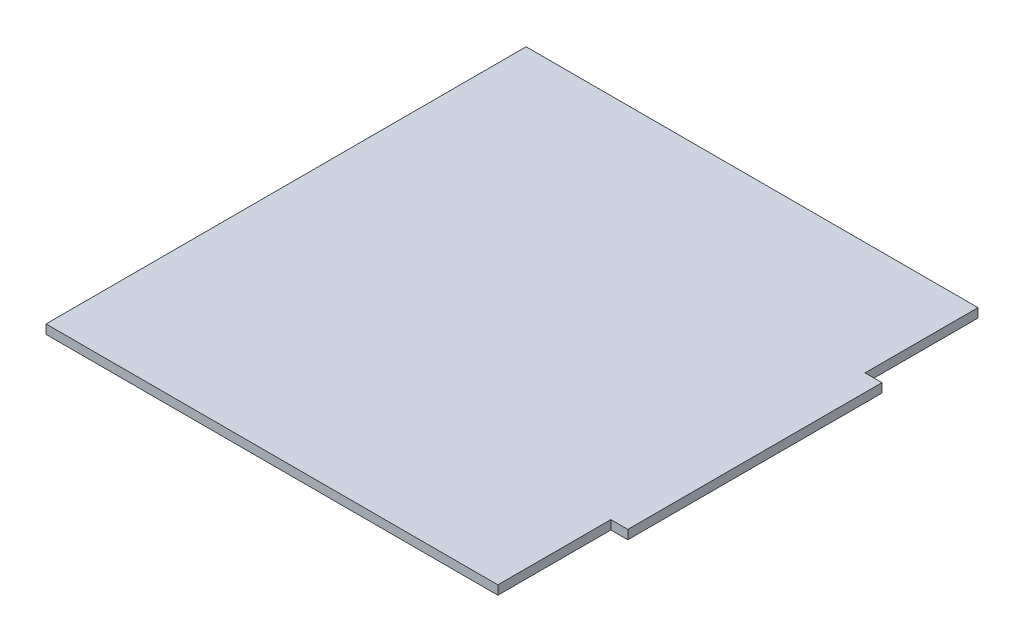
ISO-10303-21;
HEADER;
FILE_DESCRIPTION(('STEP AP214'),'2;1');
FILE_NAME('part.step','',(''),(''),'','','');
FILE_SCHEMA(('AUTOMOTIVE_DESIGN { 1 0 10303 214 1 1 1 1 }'));
ENDSEC;
DATA;
#1=APPLICATION_CONTEXT('core data for automotive mechanical design processes');
#2=APPLICATION_PROTOCOL_DEFINITION('international standard','automotive_design',2000,#1);
#3=PRODUCT_CONTEXT('',#1,'mechanical');
#4=PRODUCT('Part','Part','',(#3));
#5=PRODUCT_RELATED_PRODUCT_CATEGORY('part','',(#4));
#6=PRODUCT_DEFINITION_FORMATION('','',#4);
#7=PRODUCT_DEFINITION_CONTEXT('part definition',#1,'design');
#8=PRODUCT_DEFINITION('design','',#6,#7);
#9=PRODUCT_DEFINITION_SHAPE('','',#8);
#10=(LENGTH_UNIT() NAMED_UNIT(*) SI_UNIT(.MILLI.,.METRE.));
#11=(NAMED_UNIT(*) PLANE_ANGLE_UNIT() SI_UNIT($,.RADIAN.));
#12=(NAMED_UNIT(*) SI_UNIT($,.STERADIAN.) SOLID_ANGLE_UNIT());
#13=UNCERTAINTY_MEASURE_WITH_UNIT(LENGTH_MEASURE(1.E-05),#10,'distance_accuracy_value','');
#14=(GEOMETRIC_REPRESENTATION_CONTEXT(3) GLOBAL_UNCERTAINTY_ASSIGNED_CONTEXT((#13)) GLOBAL_UNIT_ASSIGNED_CONTEXT((#10,
#11,#12)) REPRESENTATION_CONTEXT('',''));
#15=CARTESIAN_POINT('',(0.,0.,0.));
#16=DIRECTION('',(0.,0.,1.));
#17=DIRECTION('',(1.,0.,0.));
#18=AXIS2_PLACEMENT_3D('',#15,#16,#17);
#19=CARTESIAN_POINT('',(41.5,1.6,42.5));
#20=DIRECTION('',(-1.,0.,0.));
#21=DIRECTION('',(0.,0.,1.));
#22=AXIS2_PLACEMENT_3D('',#19,#20,#21);
#23=PLANE('',#22);
#24=DIRECTION('',(0.,0.,-1.));
#25=VECTOR('',#24,1.);
#26=CARTESIAN_POINT('',(41.5,0.,42.5));
#27=LINE('',#26,#25);
#28=CARTESIAN_POINT('',(41.5,0.,22.5));
#29=VERTEX_POINT('',#28);
#30=CARTESIAN_POINT('',(41.5,0.,-22.5));
#31=VERTEX_POINT('',#30);
#32=EDGE_CURVE('E132',#29,#31,#27,.T.);
#33=ORIENTED_EDGE('',*,*,#32,.T.);
#34=DIRECTION('',(0.,1.,0.));
#35=VECTOR('',#34,1.);
#36=CARTESIAN_POINT('',(41.5,-8.4,-22.5));
#37=LINE('',#36,#35);
#38=CARTESIAN_POINT('',(41.5,1.6,-22.5));
#39=VERTEX_POINT('',#38);
#40=EDGE_CURVE('E136',#31,#39,#37,.T.);
#41=ORIENTED_EDGE('',*,*,#40,.T.);
#42=DIRECTION('',(0.,0.,-1.));
#43=VECTOR('',#42,1.);
#44=CARTESIAN_POINT('',(41.5,1.6,42.5));
#45=LINE('',#44,#43);
#46=CARTESIAN_POINT('',(41.5,1.6,22.5));
#47=VERTEX_POINT('',#46);
#48=EDGE_CURVE('E121',#47,#39,#45,.T.);
#49=ORIENTED_EDGE('',*,*,#48,.F.);
#50=DIRECTION('',(0.,1.,0.));
#51=VECTOR('',#50,1.);
#52=CARTESIAN_POINT('',(41.5,-8.4,22.5));
#53=LINE('',#52,#51);
#54=EDGE_CURVE('E161',#29,#47,#53,.T.);
#55=ORIENTED_EDGE('',*,*,#54,.F.);
#56=EDGE_LOOP('',(#33,#41,#49,#55));
#57=FACE_BOUND('',#56,.T.);
#58=ADVANCED_FACE('F37',(#57),#23,.F.);
#59=CARTESIAN_POINT('',(-41.5,1.6,-42.5));
#60=DIRECTION('',(0.,0.,1.));
#61=DIRECTION('',(1.,0.,0.));
#62=AXIS2_PLACEMENT_3D('',#59,#60,#61);
#63=PLANE('',#62);
#64=DIRECTION('',(-1.,0.,0.));
#65=VECTOR('',#64,1.);
#66=CARTESIAN_POINT('',(-41.5,1.6,-42.5));
#67=LINE('',#66,#65);
#68=CARTESIAN_POINT('',(38.5,1.6,-42.5));
#69=VERTEX_POINT('',#68);
#70=CARTESIAN_POINT('',(-41.5,1.6,-42.5));
#71=VERTEX_POINT('',#70);
#72=EDGE_CURVE('E112',#69,#71,#67,.T.);
#73=ORIENTED_EDGE('',*,*,#72,.F.);
#74=DIRECTION('',(0.,1.,0.));
#75=VECTOR('',#74,1.);
#76=CARTESIAN_POINT('',(38.5,-8.4,-42.5));
#77=LINE('',#76,#75);
#78=CARTESIAN_POINT('',(38.5,0.,-42.5));
#79=VERTEX_POINT('',#78);
#80=EDGE_CURVE('E98',#79,#69,#77,.T.);
#81=ORIENTED_EDGE('',*,*,#80,.F.);
#82=DIRECTION('',(-1.,0.,0.));
#83=VECTOR('',#82,1.);
#84=CARTESIAN_POINT('',(-41.5,0.,-42.5));
#85=LINE('',#84,#83);
#86=CARTESIAN_POINT('',(-41.5,0.,-42.5));
#87=VERTEX_POINT('',#86);
#88=EDGE_CURVE('E135',#79,#87,#85,.T.);
#89=ORIENTED_EDGE('',*,*,#88,.T.);
#90=DIRECTION('',(0.,-1.,0.));
#91=VECTOR('',#90,1.);
#92=CARTESIAN_POINT('',(-41.5,1.6,-42.5));
#93=LINE('',#92,#91);
#94=EDGE_CURVE('E118',#71,#87,#93,.T.);
#95=ORIENTED_EDGE('',*,*,#94,.F.);
#96=EDGE_LOOP('',(#73,#81,#89,#95));
#97=FACE_BOUND('',#96,.T.);
#98=ADVANCED_FACE('F116',(#97),#63,.F.);
#99=CARTESIAN_POINT('',(-41.5,1.6,42.5));
#100=DIRECTION('',(1.,0.,0.));
#101=DIRECTION('',(0.,0.,-1.));
#102=AXIS2_PLACEMENT_3D('',#99,#100,#101);
#103=PLANE('',#102);
#104=DIRECTION('',(0.,0.,1.));
#105=VECTOR('',#104,1.);
#106=CARTESIAN_POINT('',(-41.5,0.,42.5));
#107=LINE('',#106,#105);
#108=CARTESIAN_POINT('',(-41.5,0.,42.5));
#109=VERTEX_POINT('',#108);
#110=EDGE_CURVE('E138',#87,#109,#107,.T.);
#111=ORIENTED_EDGE('',*,*,#110,.T.);
#112=DIRECTION('',(0.,-1.,0.));
#113=VECTOR('',#112,1.);
#114=CARTESIAN_POINT('',(-41.5,1.6,42.5));
#115=LINE('',#114,#113);
#116=CARTESIAN_POINT('',(-41.5,1.6,42.5));
#117=VERTEX_POINT('',#116);
#118=EDGE_CURVE('E131',#117,#109,#115,.T.);
#119=ORIENTED_EDGE('',*,*,#118,.F.);
#120=DIRECTION('',(0.,0.,1.));
#121=VECTOR('',#120,1.);
#122=CARTESIAN_POINT('',(-41.5,1.6,42.5));
#123=LINE('',#122,#121);
#124=EDGE_CURVE('E120',#71,#117,#123,.T.);
#125=ORIENTED_EDGE('',*,*,#124,.F.);
#126=ORIENTED_EDGE('',*,*,#94,.T.);
#127=EDGE_LOOP('',(#111,#119,#125,#126));
#128=FACE_BOUND('',#127,.T.);
#129=ADVANCED_FACE('F179',(#128),#103,.F.);
#130=CARTESIAN_POINT('',(-41.5,1.6,42.5));
#131=DIRECTION('',(0.,0.,-1.));
#132=DIRECTION('',(-1.,0.,0.));
#133=AXIS2_PLACEMENT_3D('',#130,#131,#132);
#134=PLANE('',#133);
#135=DIRECTION('',(1.,0.,0.));
#136=VECTOR('',#135,1.);
#137=CARTESIAN_POINT('',(-41.5,0.,42.5));
#138=LINE('',#137,#136);
#139=CARTESIAN_POINT('',(38.5,0.,42.5));
#140=VERTEX_POINT('',#139);
#141=EDGE_CURVE('E125',#109,#140,#138,.T.);
#142=ORIENTED_EDGE('',*,*,#141,.T.);
#143=DIRECTION('',(0.,1.,0.));
#144=VECTOR('',#143,1.);
#145=CARTESIAN_POINT('',(38.5,-8.4,42.5));
#146=LINE('',#145,#144);
#147=CARTESIAN_POINT('',(38.5,1.6,42.5));
#148=VERTEX_POINT('',#147);
#149=EDGE_CURVE('E153',#140,#148,#146,.T.);
#150=ORIENTED_EDGE('',*,*,#149,.T.);
#151=DIRECTION('',(1.,0.,0.));
#152=VECTOR('',#151,1.);
#153=CARTESIAN_POINT('',(-41.5,1.6,42.5));
#154=LINE('',#153,#152);
#155=EDGE_CURVE('E123',#117,#148,#154,.T.);
#156=ORIENTED_EDGE('',*,*,#155,.F.);
#157=ORIENTED_EDGE('',*,*,#118,.T.);
#158=EDGE_LOOP('',(#142,#150,#156,#157));
#159=FACE_BOUND('',#158,.T.);
#160=ADVANCED_FACE('F175',(#159),#134,.F.);
#161=CARTESIAN_POINT('',(0.,1.6,0.));
#162=DIRECTION('',(0.,-1.,0.));
#163=DIRECTION('',(0.,0.,-1.));
#164=AXIS2_PLACEMENT_3D('',#161,#162,#163);
#165=PLANE('',#164);
#166=ORIENTED_EDGE('',*,*,#48,.T.);
#167=DIRECTION('',(1.,0.,0.));
#168=VECTOR('',#167,1.);
#169=CARTESIAN_POINT('',(41.5,1.6,-22.5));
#170=LINE('',#169,#168);
#171=CARTESIAN_POINT('',(38.5,1.6,-22.5));
#172=VERTEX_POINT('',#171);
#173=EDGE_CURVE('E107',#172,#39,#170,.T.);
#174=ORIENTED_EDGE('',*,*,#173,.F.);
#175=DIRECTION('',(0.,0.,1.));
#176=VECTOR('',#175,1.);
#177=CARTESIAN_POINT('',(38.5,1.6,-42.5));
#178=LINE('',#177,#176);
#179=EDGE_CURVE('E101',#69,#172,#178,.T.);
#180=ORIENTED_EDGE('',*,*,#179,.F.);
#181=ORIENTED_EDGE('',*,*,#72,.T.);
#182=ORIENTED_EDGE('',*,*,#124,.T.);
#183=ORIENTED_EDGE('',*,*,#155,.T.);
#184=DIRECTION('',(0.,0.,1.));
#185=VECTOR('',#184,1.);
#186=CARTESIAN_POINT('',(38.5,1.6,42.5));
#187=LINE('',#186,#185);
#188=CARTESIAN_POINT('',(38.5,1.6,22.5));
#189=VERTEX_POINT('',#188);
#190=EDGE_CURVE('E166',#189,#148,#187,.T.);
#191=ORIENTED_EDGE('',*,*,#190,.F.);
#192=DIRECTION('',(-1.,0.,0.));
#193=VECTOR('',#192,1.);
#194=CARTESIAN_POINT('',(41.5,1.6,22.5));
#195=LINE('',#194,#193);
#196=EDGE_CURVE('E114',#47,#189,#195,.T.);
#197=ORIENTED_EDGE('',*,*,#196,.F.);
#198=EDGE_LOOP('',(#166,#174,#180,#181,#182,#183,#191,#197));
#199=FACE_BOUND('',#198,.T.);
#200=ADVANCED_FACE('F111',(#199),#165,.F.);
#201=CARTESIAN_POINT('',(0.,0.,0.));
#202=DIRECTION('',(0.,-1.,0.));
#203=DIRECTION('',(0.,0.,-1.));
#204=AXIS2_PLACEMENT_3D('',#201,#202,#203);
#205=PLANE('',#204);
#206=DIRECTION('',(-1.,0.,0.));
#207=VECTOR('',#206,1.);
#208=CARTESIAN_POINT('',(0.,0.,-22.5));
#209=LINE('',#208,#207);
#210=CARTESIAN_POINT('',(38.5,0.,-22.5));
#211=VERTEX_POINT('',#210);
#212=EDGE_CURVE('E11',#31,#211,#209,.T.);
#213=ORIENTED_EDGE('',*,*,#212,.F.);
#214=ORIENTED_EDGE('',*,*,#32,.F.);
#215=DIRECTION('',(1.,0.,0.));
#216=VECTOR('',#215,1.);
#217=CARTESIAN_POINT('',(0.,0.,22.5));
#218=LINE('',#217,#216);
#219=CARTESIAN_POINT('',(38.5,0.,22.5));
#220=VERTEX_POINT('',#219);
#221=EDGE_CURVE('E145',#220,#29,#218,.T.);
#222=ORIENTED_EDGE('',*,*,#221,.F.);
#223=DIRECTION('',(0.,0.,-1.));
#224=VECTOR('',#223,1.);
#225=CARTESIAN_POINT('',(38.5,0.,0.));
#226=LINE('',#225,#224);
#227=EDGE_CURVE('E147',#140,#220,#226,.T.);
#228=ORIENTED_EDGE('',*,*,#227,.F.);
#229=ORIENTED_EDGE('',*,*,#141,.F.);
#230=ORIENTED_EDGE('',*,*,#110,.F.);
#231=ORIENTED_EDGE('',*,*,#88,.F.);
#232=DIRECTION('',(0.,0.,-1.));
#233=VECTOR('',#232,1.);
#234=CARTESIAN_POINT('',(38.5,0.,0.));
#235=LINE('',#234,#233);
#236=EDGE_CURVE('E44',#211,#79,#235,.T.);
#237=ORIENTED_EDGE('',*,*,#236,.F.);
#238=EDGE_LOOP('',(#213,#214,#222,#228,#229,#230,#231,#237));
#239=FACE_BOUND('',#238,.T.);
#240=ADVANCED_FACE('F158',(#239),#205,.T.);
#241=CARTESIAN_POINT('',(38.5,-8.4,42.5));
#242=DIRECTION('',(-1.,0.,0.));
#243=DIRECTION('',(0.,0.,1.));
#244=AXIS2_PLACEMENT_3D('',#241,#242,#243);
#245=PLANE('',#244);
#246=ORIENTED_EDGE('',*,*,#227,.T.);
#247=DIRECTION('',(0.,1.,0.));
#248=VECTOR('',#247,1.);
#249=CARTESIAN_POINT('',(38.5,-8.4,22.5));
#250=LINE('',#249,#248);
#251=EDGE_CURVE('E58',#220,#189,#250,.T.);
#252=ORIENTED_EDGE('',*,*,#251,.T.);
#253=ORIENTED_EDGE('',*,*,#190,.T.);
#254=ORIENTED_EDGE('',*,*,#149,.F.);
#255=EDGE_LOOP('',(#246,#252,#253,#254));
#256=FACE_BOUND('',#255,.T.);
#257=ADVANCED_FACE('F151',(#256),#245,.F.);
#258=CARTESIAN_POINT('',(41.5,-8.4,22.5));
#259=DIRECTION('',(0.,0.,-1.));
#260=DIRECTION('',(-1.,0.,0.));
#261=AXIS2_PLACEMENT_3D('',#258,#259,#260);
#262=PLANE('',#261);
#263=ORIENTED_EDGE('',*,*,#221,.T.);
#264=ORIENTED_EDGE('',*,*,#54,.T.);
#265=ORIENTED_EDGE('',*,*,#196,.T.);
#266=ORIENTED_EDGE('',*,*,#251,.F.);
#267=EDGE_LOOP('',(#263,#264,#265,#266));
#268=FACE_BOUND('',#267,.T.);
#269=ADVANCED_FACE('F160',(#268),#262,.F.);
#270=CARTESIAN_POINT('',(41.5,-8.4,-22.5));
#271=DIRECTION('',(0.,0.,1.));
#272=DIRECTION('',(1.,0.,0.));
#273=AXIS2_PLACEMENT_3D('',#270,#271,#272);
#274=PLANE('',#273);
#275=ORIENTED_EDGE('',*,*,#212,.T.);
#276=DIRECTION('',(0.,1.,0.));
#277=VECTOR('',#276,1.);
#278=CARTESIAN_POINT('',(38.5,-8.4,-22.5));
#279=LINE('',#278,#277);
#280=EDGE_CURVE('E51',#211,#172,#279,.T.);
#281=ORIENTED_EDGE('',*,*,#280,.T.);
#282=ORIENTED_EDGE('',*,*,#173,.T.);
#283=ORIENTED_EDGE('',*,*,#40,.F.);
#284=EDGE_LOOP('',(#275,#281,#282,#283));
#285=FACE_BOUND('',#284,.T.);
#286=ADVANCED_FACE('F239',(#285),#274,.F.);
#287=CARTESIAN_POINT('',(38.5,-8.4,-42.5));
#288=DIRECTION('',(-1.,0.,0.));
#289=DIRECTION('',(0.,0.,1.));
#290=AXIS2_PLACEMENT_3D('',#287,#288,#289);
#291=PLANE('',#290);
#292=ORIENTED_EDGE('',*,*,#236,.T.);
#293=ORIENTED_EDGE('',*,*,#80,.T.);
#294=ORIENTED_EDGE('',*,*,#179,.T.);
#295=ORIENTED_EDGE('',*,*,#280,.F.);
#296=EDGE_LOOP('',(#292,#293,#294,#295));
#297=FACE_BOUND('',#296,.T.);
#298=ADVANCED_FACE('F100',(#297),#291,.F.);
#299=CLOSED_SHELL('',(#58,#98,#129,#160,#200,#240,#257,#269,#286,#298));
#300=MANIFOLD_SOLID_BREP('B2',#299);
#301=ADVANCED_BREP_SHAPE_REPRESENTATION('',(#18,#300),#14);
#302=SHAPE_DEFINITION_REPRESENTATION(#9,#301);
ENDSEC;
END-ISO-10303-21;
